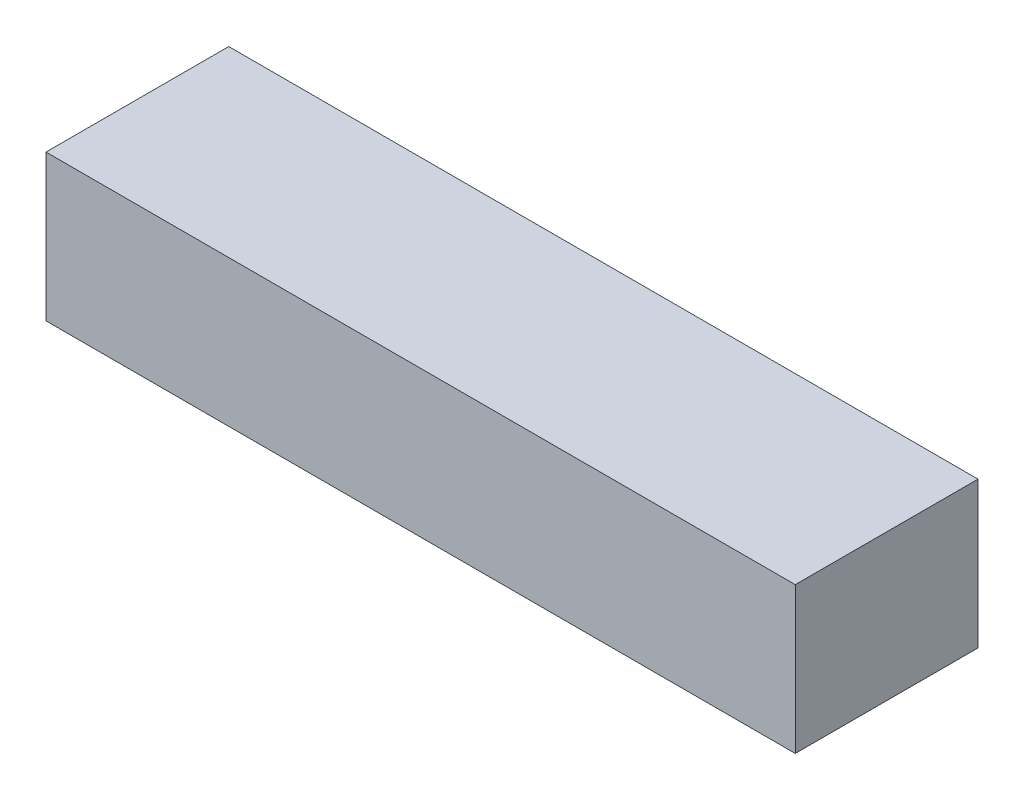
ISO-10303-21;
HEADER;
FILE_DESCRIPTION(('STEP AP214'),'2;1');
FILE_NAME('part.step','',(''),(''),'','','');
FILE_SCHEMA(('AUTOMOTIVE_DESIGN { 1 0 10303 214 1 1 1 1 }'));
ENDSEC;
DATA;
#1=APPLICATION_CONTEXT('core data for automotive mechanical design processes');
#2=APPLICATION_PROTOCOL_DEFINITION('international standard','automotive_design',2000,#1);
#3=PRODUCT_CONTEXT('',#1,'mechanical');
#4=PRODUCT('Part','Part','',(#3));
#5=PRODUCT_RELATED_PRODUCT_CATEGORY('part','',(#4));
#6=PRODUCT_DEFINITION_FORMATION('','',#4);
#7=PRODUCT_DEFINITION_CONTEXT('part definition',#1,'design');
#8=PRODUCT_DEFINITION('design','',#6,#7);
#9=PRODUCT_DEFINITION_SHAPE('','',#8);
#10=(LENGTH_UNIT() NAMED_UNIT(*) SI_UNIT(.MILLI.,.METRE.));
#11=(NAMED_UNIT(*) PLANE_ANGLE_UNIT() SI_UNIT($,.RADIAN.));
#12=(NAMED_UNIT(*) SI_UNIT($,.STERADIAN.) SOLID_ANGLE_UNIT());
#13=UNCERTAINTY_MEASURE_WITH_UNIT(LENGTH_MEASURE(1.E-05),#10,'distance_accuracy_value','');
#14=(GEOMETRIC_REPRESENTATION_CONTEXT(3) GLOBAL_UNCERTAINTY_ASSIGNED_CONTEXT((#13)) GLOBAL_UNIT_ASSIGNED_CONTEXT((#10,
#11,#12)) REPRESENTATION_CONTEXT('',''));
#15=CARTESIAN_POINT('',(0.,0.,0.));
#16=DIRECTION('',(0.,0.,1.));
#17=DIRECTION('',(1.,0.,0.));
#18=AXIS2_PLACEMENT_3D('',#15,#16,#17);
#19=CARTESIAN_POINT('',(65.0875,25.4,15.875));
#20=DIRECTION('',(-1.,0.,0.));
#21=DIRECTION('',(0.,0.,1.));
#22=AXIS2_PLACEMENT_3D('',#19,#20,#21);
#23=PLANE('',#22);
#24=DIRECTION('',(0.,0.,-1.));
#25=VECTOR('',#24,1.);
#26=CARTESIAN_POINT('',(65.0875,0.,15.875));
#27=LINE('',#26,#25);
#28=CARTESIAN_POINT('',(65.0875,0.,15.875));
#29=VERTEX_POINT('',#28);
#30=CARTESIAN_POINT('',(65.0875,0.,-15.875));
#31=VERTEX_POINT('',#30);
#32=EDGE_CURVE('E107',#29,#31,#27,.T.);
#33=ORIENTED_EDGE('',*,*,#32,.T.);
#34=DIRECTION('',(0.,-1.,0.));
#35=VECTOR('',#34,1.);
#36=CARTESIAN_POINT('',(65.0875,25.4,-15.875));
#37=LINE('',#36,#35);
#38=CARTESIAN_POINT('',(65.0875,25.4,-15.875));
#39=VERTEX_POINT('',#38);
#40=EDGE_CURVE('E11',#39,#31,#37,.T.);
#41=ORIENTED_EDGE('',*,*,#40,.F.);
#42=DIRECTION('',(0.,0.,-1.));
#43=VECTOR('',#42,1.);
#44=CARTESIAN_POINT('',(65.0875,25.4,15.875));
#45=LINE('',#44,#43);
#46=CARTESIAN_POINT('',(65.0875,25.4,15.875));
#47=VERTEX_POINT('',#46);
#48=EDGE_CURVE('E91',#47,#39,#45,.T.);
#49=ORIENTED_EDGE('',*,*,#48,.F.);
#50=DIRECTION('',(0.,-1.,0.));
#51=VECTOR('',#50,1.);
#52=CARTESIAN_POINT('',(65.0875,25.4,15.875));
#53=LINE('',#52,#51);
#54=EDGE_CURVE('E103',#47,#29,#53,.T.);
#55=ORIENTED_EDGE('',*,*,#54,.T.);
#56=EDGE_LOOP('',(#33,#41,#49,#55));
#57=FACE_BOUND('',#56,.T.);
#58=ADVANCED_FACE('F39',(#57),#23,.F.);
#59=CARTESIAN_POINT('',(-65.0875,25.4,-15.875));
#60=DIRECTION('',(0.,0.,1.));
#61=DIRECTION('',(1.,0.,0.));
#62=AXIS2_PLACEMENT_3D('',#59,#60,#61);
#63=PLANE('',#62);
#64=DIRECTION('',(-1.,0.,0.));
#65=VECTOR('',#64,1.);
#66=CARTESIAN_POINT('',(-65.0875,0.,-15.875));
#67=LINE('',#66,#65);
#68=CARTESIAN_POINT('',(-65.0875,0.,-15.875));
#69=VERTEX_POINT('',#68);
#70=EDGE_CURVE('E96',#31,#69,#67,.T.);
#71=ORIENTED_EDGE('',*,*,#70,.T.);
#72=DIRECTION('',(0.,-1.,0.));
#73=VECTOR('',#72,1.);
#74=CARTESIAN_POINT('',(-65.0875,25.4,-15.875));
#75=LINE('',#74,#73);
#76=CARTESIAN_POINT('',(-65.0875,25.4,-15.875));
#77=VERTEX_POINT('',#76);
#78=EDGE_CURVE('E48',#77,#69,#75,.T.);
#79=ORIENTED_EDGE('',*,*,#78,.F.);
#80=DIRECTION('',(-1.,0.,0.));
#81=VECTOR('',#80,1.);
#82=CARTESIAN_POINT('',(-65.0875,25.4,-15.875));
#83=LINE('',#82,#81);
#84=EDGE_CURVE('E86',#39,#77,#83,.T.);
#85=ORIENTED_EDGE('',*,*,#84,.F.);
#86=ORIENTED_EDGE('',*,*,#40,.T.);
#87=EDGE_LOOP('',(#71,#79,#85,#86));
#88=FACE_BOUND('',#87,.T.);
#89=ADVANCED_FACE('F95',(#88),#63,.F.);
#90=CARTESIAN_POINT('',(-65.0875,25.4,15.875));
#91=DIRECTION('',(1.,0.,0.));
#92=DIRECTION('',(0.,0.,-1.));
#93=AXIS2_PLACEMENT_3D('',#90,#91,#92);
#94=PLANE('',#93);
#95=DIRECTION('',(0.,0.,1.));
#96=VECTOR('',#95,1.);
#97=CARTESIAN_POINT('',(-65.0875,0.,15.875));
#98=LINE('',#97,#96);
#99=CARTESIAN_POINT('',(-65.0875,0.,15.875));
#100=VERTEX_POINT('',#99);
#101=EDGE_CURVE('E73',#69,#100,#98,.T.);
#102=ORIENTED_EDGE('',*,*,#101,.T.);
#103=DIRECTION('',(0.,-1.,0.));
#104=VECTOR('',#103,1.);
#105=CARTESIAN_POINT('',(-65.0875,25.4,15.875));
#106=LINE('',#105,#104);
#107=CARTESIAN_POINT('',(-65.0875,25.4,15.875));
#108=VERTEX_POINT('',#107);
#109=EDGE_CURVE('E98',#108,#100,#106,.T.);
#110=ORIENTED_EDGE('',*,*,#109,.F.);
#111=DIRECTION('',(0.,0.,1.));
#112=VECTOR('',#111,1.);
#113=CARTESIAN_POINT('',(-65.0875,25.4,15.875));
#114=LINE('',#113,#112);
#115=EDGE_CURVE('E89',#77,#108,#114,.T.);
#116=ORIENTED_EDGE('',*,*,#115,.F.);
#117=ORIENTED_EDGE('',*,*,#78,.T.);
#118=EDGE_LOOP('',(#102,#110,#116,#117));
#119=FACE_BOUND('',#118,.T.);
#120=ADVANCED_FACE('F99',(#119),#94,.F.);
#121=CARTESIAN_POINT('',(-65.0875,25.4,15.875));
#122=DIRECTION('',(0.,0.,-1.));
#123=DIRECTION('',(-1.,0.,0.));
#124=AXIS2_PLACEMENT_3D('',#121,#122,#123);
#125=PLANE('',#124);
#126=DIRECTION('',(1.,0.,0.));
#127=VECTOR('',#126,1.);
#128=CARTESIAN_POINT('',(-65.0875,0.,15.875));
#129=LINE('',#128,#127);
#130=EDGE_CURVE('E79',#100,#29,#129,.T.);
#131=ORIENTED_EDGE('',*,*,#130,.T.);
#132=ORIENTED_EDGE('',*,*,#54,.F.);
#133=DIRECTION('',(1.,0.,0.));
#134=VECTOR('',#133,1.);
#135=CARTESIAN_POINT('',(-65.0875,25.4,15.875));
#136=LINE('',#135,#134);
#137=EDGE_CURVE('E56',#108,#47,#136,.T.);
#138=ORIENTED_EDGE('',*,*,#137,.F.);
#139=ORIENTED_EDGE('',*,*,#109,.T.);
#140=EDGE_LOOP('',(#131,#132,#138,#139));
#141=FACE_BOUND('',#140,.T.);
#142=ADVANCED_FACE('F120',(#141),#125,.F.);
#143=CARTESIAN_POINT('',(0.,25.4,0.));
#144=DIRECTION('',(0.,-1.,0.));
#145=DIRECTION('',(0.,0.,-1.));
#146=AXIS2_PLACEMENT_3D('',#143,#144,#145);
#147=PLANE('',#146);
#148=ORIENTED_EDGE('',*,*,#48,.T.);
#149=ORIENTED_EDGE('',*,*,#84,.T.);
#150=ORIENTED_EDGE('',*,*,#115,.T.);
#151=ORIENTED_EDGE('',*,*,#137,.T.);
#152=EDGE_LOOP('',(#148,#149,#150,#151));
#153=FACE_BOUND('',#152,.T.);
#154=ADVANCED_FACE('F87',(#153),#147,.F.);
#155=CARTESIAN_POINT('',(0.,0.,0.));
#156=DIRECTION('',(0.,-1.,0.));
#157=DIRECTION('',(0.,0.,-1.));
#158=AXIS2_PLACEMENT_3D('',#155,#156,#157);
#159=PLANE('',#158);
#160=ORIENTED_EDGE('',*,*,#32,.F.);
#161=ORIENTED_EDGE('',*,*,#130,.F.);
#162=ORIENTED_EDGE('',*,*,#101,.F.);
#163=ORIENTED_EDGE('',*,*,#70,.F.);
#164=EDGE_LOOP('',(#160,#161,#162,#163));
#165=FACE_BOUND('',#164,.T.);
#166=ADVANCED_FACE('F123',(#165),#159,.T.);
#167=CLOSED_SHELL('',(#58,#89,#120,#142,#154,#166));
#168=MANIFOLD_SOLID_BREP('B2',#167);
#169=ADVANCED_BREP_SHAPE_REPRESENTATION('',(#18,#168),#14);
#170=SHAPE_DEFINITION_REPRESENTATION(#9,#169);
ENDSEC;
END-ISO-10303-21;
